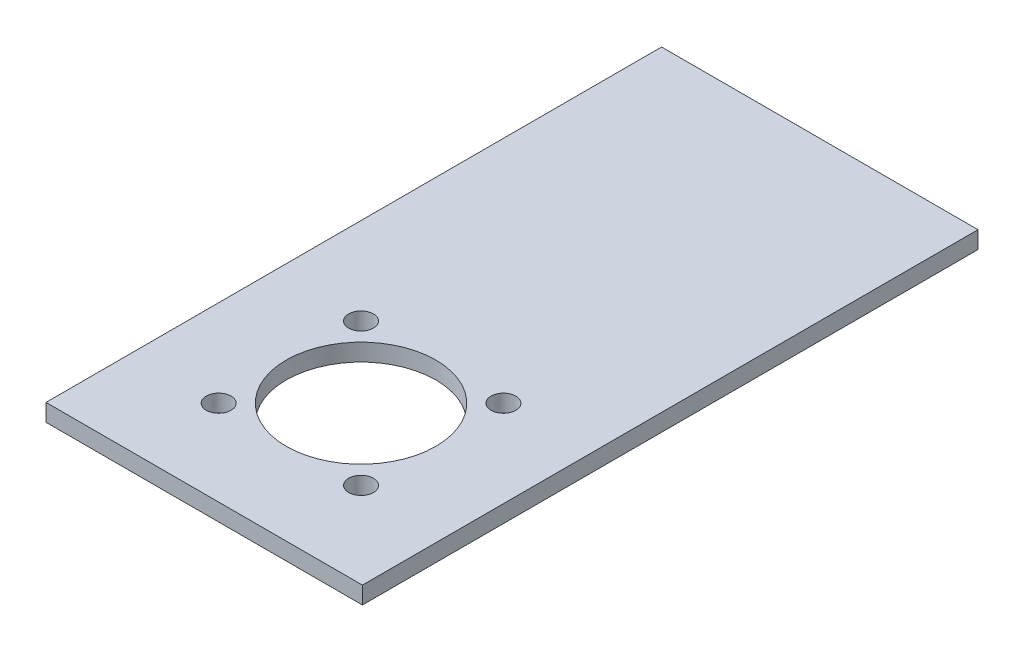
ISO-10303-21;
HEADER;
FILE_DESCRIPTION(('STEP AP214'),'2;1');
FILE_NAME('part.step','',(''),(''),'','','');
FILE_SCHEMA(('AUTOMOTIVE_DESIGN { 1 0 10303 214 1 1 1 1 }'));
ENDSEC;
DATA;
#1=APPLICATION_CONTEXT('core data for automotive mechanical design processes');
#2=APPLICATION_PROTOCOL_DEFINITION('international standard','automotive_design',2000,#1);
#3=PRODUCT_CONTEXT('',#1,'mechanical');
#4=PRODUCT('Part','Part','',(#3));
#5=PRODUCT_RELATED_PRODUCT_CATEGORY('part','',(#4));
#6=PRODUCT_DEFINITION_FORMATION('','',#4);
#7=PRODUCT_DEFINITION_CONTEXT('part definition',#1,'design');
#8=PRODUCT_DEFINITION('design','',#6,#7);
#9=PRODUCT_DEFINITION_SHAPE('','',#8);
#10=(LENGTH_UNIT() NAMED_UNIT(*) SI_UNIT(.MILLI.,.METRE.));
#11=(NAMED_UNIT(*) PLANE_ANGLE_UNIT() SI_UNIT($,.RADIAN.));
#12=(NAMED_UNIT(*) SI_UNIT($,.STERADIAN.) SOLID_ANGLE_UNIT());
#13=UNCERTAINTY_MEASURE_WITH_UNIT(LENGTH_MEASURE(1.E-05),#10,'distance_accuracy_value','');
#14=(GEOMETRIC_REPRESENTATION_CONTEXT(3) GLOBAL_UNCERTAINTY_ASSIGNED_CONTEXT((#13)) GLOBAL_UNIT_ASSIGNED_CONTEXT((#10,
#11,#12)) REPRESENTATION_CONTEXT('',''));
#15=CARTESIAN_POINT('',(0.,0.,0.));
#16=DIRECTION('',(0.,0.,1.));
#17=DIRECTION('',(1.,0.,0.));
#18=AXIS2_PLACEMENT_3D('',#15,#16,#17);
#19=CARTESIAN_POINT('',(0.,3.,0.));
#20=DIRECTION('',(0.,1.,0.));
#21=DIRECTION('',(0.,0.,1.));
#22=AXIS2_PLACEMENT_3D('',#19,#20,#21);
#23=PLANE('',#22);
#24=CARTESIAN_POINT('',(-12.374368670764,3.,45.9730234775499));
#25=DIRECTION('',(0.,1.,0.));
#26=DIRECTION('',(0.,0.,1.));
#27=AXIS2_PLACEMENT_3D('',#24,#25,#26);
#28=CIRCLE('',#27,2.15);
#29=CARTESIAN_POINT('',(-12.374368670764,3.,48.1230234775499));
#30=VERTEX_POINT('',#29);
#31=EDGE_CURVE('E127',#30,#30,#28,.T.);
#32=ORIENTED_EDGE('',*,*,#31,.F.);
#33=EDGE_LOOP('',(#32));
#34=FACE_BOUND('',#33,.T.);
#35=CARTESIAN_POINT('',(12.3743686707646,3.,21.2242861360201));
#36=DIRECTION('',(0.,1.,0.));
#37=DIRECTION('',(0.,0.,1.));
#38=AXIS2_PLACEMENT_3D('',#35,#36,#37);
#39=CIRCLE('',#38,2.15);
#40=CARTESIAN_POINT('',(12.3743686707646,3.,23.3742861360201));
#41=VERTEX_POINT('',#40);
#42=EDGE_CURVE('E115',#41,#41,#39,.T.);
#43=ORIENTED_EDGE('',*,*,#42,.F.);
#44=EDGE_LOOP('',(#43));
#45=FACE_BOUND('',#44,.T.);
#46=DIRECTION('',(0.,0.,1.));
#47=VECTOR('',#46,1.);
#48=CARTESIAN_POINT('',(-27.5,3.,-46.1413451932153));
#49=LINE('',#48,#47);
#50=CARTESIAN_POINT('',(-27.5,3.,-46.1413451932153));
#51=VERTEX_POINT('',#50);
#52=CARTESIAN_POINT('',(-27.5,3.,60.8586548067847));
#53=VERTEX_POINT('',#52);
#54=EDGE_CURVE('E85',#51,#53,#49,.T.);
#55=ORIENTED_EDGE('',*,*,#54,.T.);
#56=DIRECTION('',(1.,0.,0.));
#57=VECTOR('',#56,1.);
#58=CARTESIAN_POINT('',(-27.5,3.,60.8586548067847));
#59=LINE('',#58,#57);
#60=CARTESIAN_POINT('',(27.5,3.,60.8586548067847));
#61=VERTEX_POINT('',#60);
#62=EDGE_CURVE('E80',#53,#61,#59,.T.);
#63=ORIENTED_EDGE('',*,*,#62,.T.);
#64=DIRECTION('',(0.,0.,-1.));
#65=VECTOR('',#64,1.);
#66=CARTESIAN_POINT('',(27.5,3.,-46.1413451932153));
#67=LINE('',#66,#65);
#68=CARTESIAN_POINT('',(27.5,3.,-46.1413451932153));
#69=VERTEX_POINT('',#68);
#70=EDGE_CURVE('E83',#61,#69,#67,.T.);
#71=ORIENTED_EDGE('',*,*,#70,.T.);
#72=DIRECTION('',(-1.,0.,0.));
#73=VECTOR('',#72,1.);
#74=CARTESIAN_POINT('',(-27.5,3.,-46.1413451932153));
#75=LINE('',#74,#73);
#76=EDGE_CURVE('E50',#69,#51,#75,.T.);
#77=ORIENTED_EDGE('',*,*,#76,.T.);
#78=EDGE_LOOP('',(#55,#63,#71,#77));
#79=FACE_BOUND('',#78,.T.);
#80=CARTESIAN_POINT('',(0.,3.,33.5986548067847));
#81=DIRECTION('',(0.,1.,0.));
#82=DIRECTION('',(0.,0.,1.));
#83=AXIS2_PLACEMENT_3D('',#80,#81,#82);
#84=CIRCLE('',#83,13.);
#85=CARTESIAN_POINT('',(0.,3.,46.5986548067847));
#86=VERTEX_POINT('',#85);
#87=EDGE_CURVE('E100',#86,#86,#84,.T.);
#88=ORIENTED_EDGE('',*,*,#87,.F.);
#89=EDGE_LOOP('',(#88));
#90=FACE_BOUND('',#89,.T.);
#91=CARTESIAN_POINT('',(12.3743686707652,3.,45.9730234775493));
#92=DIRECTION('',(0.,1.,0.));
#93=DIRECTION('',(0.,0.,1.));
#94=AXIS2_PLACEMENT_3D('',#91,#92,#93);
#95=CIRCLE('',#94,2.15);
#96=CARTESIAN_POINT('',(12.3743686707652,3.,48.1230234775493));
#97=VERTEX_POINT('',#96);
#98=EDGE_CURVE('E121',#97,#97,#95,.T.);
#99=ORIENTED_EDGE('',*,*,#98,.F.);
#100=EDGE_LOOP('',(#99));
#101=FACE_BOUND('',#100,.T.);
#102=CARTESIAN_POINT('',(-12.3743686707645,3.,21.2242861360207));
#103=DIRECTION('',(0.,1.,0.));
#104=DIRECTION('',(0.,0.,1.));
#105=AXIS2_PLACEMENT_3D('',#102,#103,#104);
#106=CIRCLE('',#105,2.15);
#107=CARTESIAN_POINT('',(-12.3743686707645,3.,23.3742861360207));
#108=VERTEX_POINT('',#107);
#109=EDGE_CURVE('E133',#108,#108,#106,.T.);
#110=ORIENTED_EDGE('',*,*,#109,.F.);
#111=EDGE_LOOP('',(#110));
#112=FACE_BOUND('',#111,.T.);
#113=ADVANCED_FACE('F33',(#34,#45,#79,#90,#101,#112),#23,.T.);
#114=CARTESIAN_POINT('',(0.,0.,0.));
#115=DIRECTION('',(0.,1.,0.));
#116=DIRECTION('',(0.,0.,1.));
#117=AXIS2_PLACEMENT_3D('',#114,#115,#116);
#118=PLANE('',#117);
#119=CARTESIAN_POINT('',(-12.374368670764,0.,45.9730234775499));
#120=DIRECTION('',(0.,1.,0.));
#121=DIRECTION('',(0.,0.,1.));
#122=AXIS2_PLACEMENT_3D('',#119,#120,#121);
#123=CIRCLE('',#122,2.15);
#124=CARTESIAN_POINT('',(-12.374368670764,0.,48.1230234775499));
#125=VERTEX_POINT('',#124);
#126=EDGE_CURVE('E130',#125,#125,#123,.T.);
#127=ORIENTED_EDGE('',*,*,#126,.T.);
#128=EDGE_LOOP('',(#127));
#129=FACE_BOUND('',#128,.T.);
#130=CARTESIAN_POINT('',(12.3743686707646,0.,21.2242861360201));
#131=DIRECTION('',(0.,1.,0.));
#132=DIRECTION('',(0.,0.,1.));
#133=AXIS2_PLACEMENT_3D('',#130,#131,#132);
#134=CIRCLE('',#133,2.15);
#135=CARTESIAN_POINT('',(12.3743686707646,0.,23.3742861360201));
#136=VERTEX_POINT('',#135);
#137=EDGE_CURVE('E118',#136,#136,#134,.T.);
#138=ORIENTED_EDGE('',*,*,#137,.T.);
#139=EDGE_LOOP('',(#138));
#140=FACE_BOUND('',#139,.T.);
#141=DIRECTION('',(0.,0.,1.));
#142=VECTOR('',#141,1.);
#143=CARTESIAN_POINT('',(-27.5,0.,-46.1413451932153));
#144=LINE('',#143,#142);
#145=CARTESIAN_POINT('',(-27.5,0.,-46.1413451932153));
#146=VERTEX_POINT('',#145);
#147=CARTESIAN_POINT('',(-27.5,0.,60.8586548067847));
#148=VERTEX_POINT('',#147);
#149=EDGE_CURVE('E97',#146,#148,#144,.T.);
#150=ORIENTED_EDGE('',*,*,#149,.F.);
#151=DIRECTION('',(-1.,0.,0.));
#152=VECTOR('',#151,1.);
#153=CARTESIAN_POINT('',(-27.5,0.,-46.1413451932153));
#154=LINE('',#153,#152);
#155=CARTESIAN_POINT('',(27.5,0.,-46.1413451932153));
#156=VERTEX_POINT('',#155);
#157=EDGE_CURVE('E73',#156,#146,#154,.T.);
#158=ORIENTED_EDGE('',*,*,#157,.F.);
#159=DIRECTION('',(0.,0.,-1.));
#160=VECTOR('',#159,1.);
#161=CARTESIAN_POINT('',(27.5,0.,-46.1413451932153));
#162=LINE('',#161,#160);
#163=CARTESIAN_POINT('',(27.5,0.,60.8586548067847));
#164=VERTEX_POINT('',#163);
#165=EDGE_CURVE('E67',#164,#156,#162,.T.);
#166=ORIENTED_EDGE('',*,*,#165,.F.);
#167=DIRECTION('',(1.,0.,0.));
#168=VECTOR('',#167,1.);
#169=CARTESIAN_POINT('',(-27.5,0.,60.8586548067847));
#170=LINE('',#169,#168);
#171=EDGE_CURVE('E89',#148,#164,#170,.T.);
#172=ORIENTED_EDGE('',*,*,#171,.F.);
#173=EDGE_LOOP('',(#150,#158,#166,#172));
#174=FACE_BOUND('',#173,.T.);
#175=CARTESIAN_POINT('',(0.,0.,33.5986548067847));
#176=DIRECTION('',(0.,1.,0.));
#177=DIRECTION('',(0.,0.,1.));
#178=AXIS2_PLACEMENT_3D('',#175,#176,#177);
#179=CIRCLE('',#178,13.);
#180=CARTESIAN_POINT('',(0.,0.,46.5986548067847));
#181=VERTEX_POINT('',#180);
#182=EDGE_CURVE('E112',#181,#181,#179,.T.);
#183=ORIENTED_EDGE('',*,*,#182,.T.);
#184=EDGE_LOOP('',(#183));
#185=FACE_BOUND('',#184,.T.);
#186=CARTESIAN_POINT('',(12.3743686707652,0.,45.9730234775493));
#187=DIRECTION('',(0.,1.,0.));
#188=DIRECTION('',(0.,0.,1.));
#189=AXIS2_PLACEMENT_3D('',#186,#187,#188);
#190=CIRCLE('',#189,2.15);
#191=CARTESIAN_POINT('',(12.3743686707652,0.,48.1230234775493));
#192=VERTEX_POINT('',#191);
#193=EDGE_CURVE('E124',#192,#192,#190,.T.);
#194=ORIENTED_EDGE('',*,*,#193,.T.);
#195=EDGE_LOOP('',(#194));
#196=FACE_BOUND('',#195,.T.);
#197=CARTESIAN_POINT('',(-12.3743686707645,0.,21.2242861360207));
#198=DIRECTION('',(0.,1.,0.));
#199=DIRECTION('',(0.,0.,1.));
#200=AXIS2_PLACEMENT_3D('',#197,#198,#199);
#201=CIRCLE('',#200,2.15);
#202=CARTESIAN_POINT('',(-12.3743686707645,0.,23.3742861360207));
#203=VERTEX_POINT('',#202);
#204=EDGE_CURVE('E136',#203,#203,#201,.T.);
#205=ORIENTED_EDGE('',*,*,#204,.T.);
#206=EDGE_LOOP('',(#205));
#207=FACE_BOUND('',#206,.T.);
#208=ADVANCED_FACE('F108',(#129,#140,#174,#185,#196,#207),#118,.F.);
#209=CARTESIAN_POINT('',(-27.5,3.,-46.1413451932153));
#210=DIRECTION('',(1.,0.,0.));
#211=DIRECTION('',(0.,0.,-1.));
#212=AXIS2_PLACEMENT_3D('',#209,#210,#211);
#213=PLANE('',#212);
#214=ORIENTED_EDGE('',*,*,#149,.T.);
#215=DIRECTION('',(0.,-1.,0.));
#216=VECTOR('',#215,1.);
#217=CARTESIAN_POINT('',(-27.5,3.,60.8586548067847));
#218=LINE('',#217,#216);
#219=EDGE_CURVE('E11',#53,#148,#218,.T.);
#220=ORIENTED_EDGE('',*,*,#219,.F.);
#221=ORIENTED_EDGE('',*,*,#54,.F.);
#222=DIRECTION('',(0.,-1.,0.));
#223=VECTOR('',#222,1.);
#224=CARTESIAN_POINT('',(-27.5,3.,-46.1413451932153));
#225=LINE('',#224,#223);
#226=EDGE_CURVE('E93',#51,#146,#225,.T.);
#227=ORIENTED_EDGE('',*,*,#226,.T.);
#228=EDGE_LOOP('',(#214,#220,#221,#227));
#229=FACE_BOUND('',#228,.T.);
#230=ADVANCED_FACE('F35',(#229),#213,.F.);
#231=CARTESIAN_POINT('',(-27.5,3.,60.8586548067847));
#232=DIRECTION('',(0.,0.,-1.));
#233=DIRECTION('',(-1.,0.,0.));
#234=AXIS2_PLACEMENT_3D('',#231,#232,#233);
#235=PLANE('',#234);
#236=ORIENTED_EDGE('',*,*,#171,.T.);
#237=DIRECTION('',(0.,-1.,0.));
#238=VECTOR('',#237,1.);
#239=CARTESIAN_POINT('',(27.5,3.,60.8586548067847));
#240=LINE('',#239,#238);
#241=EDGE_CURVE('E42',#61,#164,#240,.T.);
#242=ORIENTED_EDGE('',*,*,#241,.F.);
#243=ORIENTED_EDGE('',*,*,#62,.F.);
#244=ORIENTED_EDGE('',*,*,#219,.T.);
#245=EDGE_LOOP('',(#236,#242,#243,#244));
#246=FACE_BOUND('',#245,.T.);
#247=ADVANCED_FACE('F88',(#246),#235,.F.);
#248=CARTESIAN_POINT('',(27.5,3.,-46.1413451932153));
#249=DIRECTION('',(-1.,0.,0.));
#250=DIRECTION('',(0.,0.,1.));
#251=AXIS2_PLACEMENT_3D('',#248,#249,#250);
#252=PLANE('',#251);
#253=ORIENTED_EDGE('',*,*,#165,.T.);
#254=DIRECTION('',(0.,-1.,0.));
#255=VECTOR('',#254,1.);
#256=CARTESIAN_POINT('',(27.5,3.,-46.1413451932153));
#257=LINE('',#256,#255);
#258=EDGE_CURVE('E90',#69,#156,#257,.T.);
#259=ORIENTED_EDGE('',*,*,#258,.F.);
#260=ORIENTED_EDGE('',*,*,#70,.F.);
#261=ORIENTED_EDGE('',*,*,#241,.T.);
#262=EDGE_LOOP('',(#253,#259,#260,#261));
#263=FACE_BOUND('',#262,.T.);
#264=ADVANCED_FACE('F91',(#263),#252,.F.);
#265=CARTESIAN_POINT('',(-27.5,3.,-46.1413451932153));
#266=DIRECTION('',(0.,0.,1.));
#267=DIRECTION('',(1.,0.,0.));
#268=AXIS2_PLACEMENT_3D('',#265,#266,#267);
#269=PLANE('',#268);
#270=ORIENTED_EDGE('',*,*,#157,.T.);
#271=ORIENTED_EDGE('',*,*,#226,.F.);
#272=ORIENTED_EDGE('',*,*,#76,.F.);
#273=ORIENTED_EDGE('',*,*,#258,.T.);
#274=EDGE_LOOP('',(#270,#271,#272,#273));
#275=FACE_BOUND('',#274,.T.);
#276=ADVANCED_FACE('F105',(#275),#269,.F.);
#277=CARTESIAN_POINT('',(0.,3.,33.5986548067847));
#278=DIRECTION('',(0.,-1.,0.));
#279=DIRECTION('',(0.,0.,-1.));
#280=AXIS2_PLACEMENT_3D('',#277,#278,#279);
#281=CYLINDRICAL_SURFACE('',#280,13.);
#282=ORIENTED_EDGE('',*,*,#87,.T.);
#283=EDGE_LOOP('',(#282));
#284=FACE_BOUND('',#283,.T.);
#285=ORIENTED_EDGE('',*,*,#182,.F.);
#286=EDGE_LOOP('',(#285));
#287=FACE_BOUND('',#286,.T.);
#288=ADVANCED_FACE('F156',(#284,#287),#281,.F.);
#289=CARTESIAN_POINT('',(12.3743686707646,3.,21.2242861360201));
#290=DIRECTION('',(0.,-1.,0.));
#291=DIRECTION('',(0.,0.,-1.));
#292=AXIS2_PLACEMENT_3D('',#289,#290,#291);
#293=CYLINDRICAL_SURFACE('',#292,2.15);
#294=ORIENTED_EDGE('',*,*,#42,.T.);
#295=EDGE_LOOP('',(#294));
#296=FACE_BOUND('',#295,.T.);
#297=ORIENTED_EDGE('',*,*,#137,.F.);
#298=EDGE_LOOP('',(#297));
#299=FACE_BOUND('',#298,.T.);
#300=ADVANCED_FACE('F202',(#296,#299),#293,.F.);
#301=CARTESIAN_POINT('',(12.3743686707652,3.,45.9730234775493));
#302=DIRECTION('',(0.,-1.,0.));
#303=DIRECTION('',(0.,0.,-1.));
#304=AXIS2_PLACEMENT_3D('',#301,#302,#303);
#305=CYLINDRICAL_SURFACE('',#304,2.15);
#306=ORIENTED_EDGE('',*,*,#98,.T.);
#307=EDGE_LOOP('',(#306));
#308=FACE_BOUND('',#307,.T.);
#309=ORIENTED_EDGE('',*,*,#193,.F.);
#310=EDGE_LOOP('',(#309));
#311=FACE_BOUND('',#310,.T.);
#312=ADVANCED_FACE('F210',(#308,#311),#305,.F.);
#313=CARTESIAN_POINT('',(-12.374368670764,3.,45.9730234775499));
#314=DIRECTION('',(0.,-1.,0.));
#315=DIRECTION('',(0.,0.,-1.));
#316=AXIS2_PLACEMENT_3D('',#313,#314,#315);
#317=CYLINDRICAL_SURFACE('',#316,2.15);
#318=ORIENTED_EDGE('',*,*,#31,.T.);
#319=EDGE_LOOP('',(#318));
#320=FACE_BOUND('',#319,.T.);
#321=ORIENTED_EDGE('',*,*,#126,.F.);
#322=EDGE_LOOP('',(#321));
#323=FACE_BOUND('',#322,.T.);
#324=ADVANCED_FACE('F218',(#320,#323),#317,.F.);
#325=CARTESIAN_POINT('',(-12.3743686707645,3.,21.2242861360207));
#326=DIRECTION('',(0.,-1.,0.));
#327=DIRECTION('',(0.,0.,-1.));
#328=AXIS2_PLACEMENT_3D('',#325,#326,#327);
#329=CYLINDRICAL_SURFACE('',#328,2.15);
#330=ORIENTED_EDGE('',*,*,#109,.T.);
#331=EDGE_LOOP('',(#330));
#332=FACE_BOUND('',#331,.T.);
#333=ORIENTED_EDGE('',*,*,#204,.F.);
#334=EDGE_LOOP('',(#333));
#335=FACE_BOUND('',#334,.T.);
#336=ADVANCED_FACE('F142',(#332,#335),#329,.F.);
#337=CLOSED_SHELL('',(#113,#208,#230,#247,#264,#276,#288,#300,#312,#324,#336));
#338=MANIFOLD_SOLID_BREP('B2',#337);
#339=ADVANCED_BREP_SHAPE_REPRESENTATION('',(#18,#338),#14);
#340=SHAPE_DEFINITION_REPRESENTATION(#9,#339);
ENDSEC;
END-ISO-10303-21;
